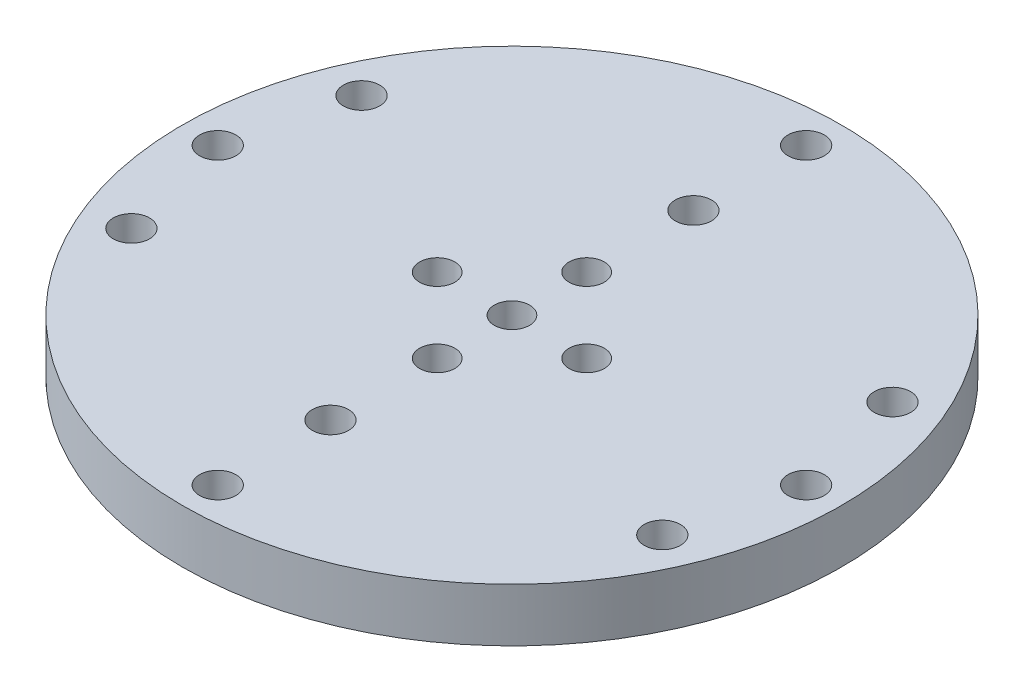
ISO-10303-21;
HEADER;
FILE_DESCRIPTION(('STEP AP214'),'2;1');
FILE_NAME('part.step','',(''),(''),'','','');
FILE_SCHEMA(('AUTOMOTIVE_DESIGN { 1 0 10303 214 1 1 1 1 }'));
ENDSEC;
DATA;
#1=APPLICATION_CONTEXT('core data for automotive mechanical design processes');
#2=APPLICATION_PROTOCOL_DEFINITION('international standard','automotive_design',2000,#1);
#3=PRODUCT_CONTEXT('',#1,'mechanical');
#4=PRODUCT('Part','Part','',(#3));
#5=PRODUCT_RELATED_PRODUCT_CATEGORY('part','',(#4));
#6=PRODUCT_DEFINITION_FORMATION('','',#4);
#7=PRODUCT_DEFINITION_CONTEXT('part definition',#1,'design');
#8=PRODUCT_DEFINITION('design','',#6,#7);
#9=PRODUCT_DEFINITION_SHAPE('','',#8);
#10=(LENGTH_UNIT() NAMED_UNIT(*) SI_UNIT(.MILLI.,.METRE.));
#11=(NAMED_UNIT(*) PLANE_ANGLE_UNIT() SI_UNIT($,.RADIAN.));
#12=(NAMED_UNIT(*) SI_UNIT($,.STERADIAN.) SOLID_ANGLE_UNIT());
#13=UNCERTAINTY_MEASURE_WITH_UNIT(LENGTH_MEASURE(1.E-05),#10,'distance_accuracy_value','');
#14=(GEOMETRIC_REPRESENTATION_CONTEXT(3) GLOBAL_UNCERTAINTY_ASSIGNED_CONTEXT((#13)) GLOBAL_UNIT_ASSIGNED_CONTEXT((#10,
#11,#12)) REPRESENTATION_CONTEXT('',''));
#15=CARTESIAN_POINT('',(0.,0.,0.));
#16=DIRECTION('',(0.,0.,1.));
#17=DIRECTION('',(1.,0.,0.));
#18=AXIS2_PLACEMENT_3D('',#15,#16,#17);
#19=CARTESIAN_POINT('',(0.,9.3,0.));
#20=DIRECTION('',(0.,1.,0.));
#21=DIRECTION('',(0.,0.,1.));
#22=AXIS2_PLACEMENT_3D('',#19,#20,#21);
#23=PLANE('',#22);
#24=CARTESIAN_POINT('',(0.,9.3,17.));
#25=DIRECTION('',(0.,-1.,0.));
#26=DIRECTION('',(0.,0.,-1.));
#27=AXIS2_PLACEMENT_3D('',#24,#25,#26);
#28=CIRCLE('',#27,1.7);
#29=CARTESIAN_POINT('',(0.,9.3,15.3));
#30=VERTEX_POINT('',#29);
#31=EDGE_CURVE('E593',#30,#30,#28,.T.);
#32=ORIENTED_EDGE('',*,*,#31,.T.);
#33=EDGE_LOOP('',(#32));
#34=FACE_BOUND('',#33,.T.);
#35=CARTESIAN_POINT('',(7.0000000000002,9.3,-1.98094713253425E-13));
#36=DIRECTION('',(0.,1.,0.));
#37=DIRECTION('',(0.,0.,1.));
#38=AXIS2_PLACEMENT_3D('',#35,#36,#37);
#39=CIRCLE('',#38,1.65000000000016);
#40=CARTESIAN_POINT('',(7.0000000000002,9.3,1.64999999999996));
#41=VERTEX_POINT('',#40);
#42=EDGE_CURVE('E58',#41,#41,#39,.F.);
#43=ORIENTED_EDGE('',*,*,#42,.T.);
#44=EDGE_LOOP('',(#43));
#45=FACE_BOUND('',#44,.T.);
#46=CARTESIAN_POINT('',(-6.9999999999998,9.3,1.98951966012828E-13));
#47=DIRECTION('',(0.,1.,0.));
#48=DIRECTION('',(0.,0.,1.));
#49=AXIS2_PLACEMENT_3D('',#46,#47,#48);
#50=CIRCLE('',#49,1.65000000000032);
#51=CARTESIAN_POINT('',(-6.9999999999998,9.3,1.65000000000052));
#52=VERTEX_POINT('',#51);
#53=EDGE_CURVE('E130',#52,#52,#50,.F.);
#54=ORIENTED_EDGE('',*,*,#53,.T.);
#55=EDGE_LOOP('',(#54));
#56=FACE_BOUND('',#55,.T.);
#57=CARTESIAN_POINT('',(3.9618942650685E-13,9.3,7.));
#58=DIRECTION('',(0.,1.,0.));
#59=DIRECTION('',(0.,0.,1.));
#60=AXIS2_PLACEMENT_3D('',#57,#58,#59);
#61=CIRCLE('',#60,1.65000000000043);
#62=CARTESIAN_POINT('',(3.9618942650685E-13,9.3,8.65000000000043));
#63=VERTEX_POINT('',#62);
#64=EDGE_CURVE('E128',#63,#63,#61,.F.);
#65=ORIENTED_EDGE('',*,*,#64,.T.);
#66=EDGE_LOOP('',(#65));
#67=FACE_BOUND('',#66,.T.);
#68=CARTESIAN_POINT('',(0.,9.3,0.));
#69=DIRECTION('',(0.,1.,0.));
#70=DIRECTION('',(0.,0.,1.));
#71=AXIS2_PLACEMENT_3D('',#68,#69,#70);
#72=CIRCLE('',#71,1.65);
#73=CARTESIAN_POINT('',(0.,9.3,1.65));
#74=VERTEX_POINT('',#73);
#75=EDGE_CURVE('E131',#74,#74,#72,.F.);
#76=ORIENTED_EDGE('',*,*,#75,.T.);
#77=EDGE_LOOP('',(#76));
#78=FACE_BOUND('',#77,.T.);
#79=CARTESIAN_POINT('',(0.,9.3,-7.));
#80=DIRECTION('',(0.,1.,0.));
#81=DIRECTION('',(0.,0.,1.));
#82=AXIS2_PLACEMENT_3D('',#79,#80,#81);
#83=CIRCLE('',#82,1.65);
#84=CARTESIAN_POINT('',(0.,9.3,-5.35));
#85=VERTEX_POINT('',#84);
#86=EDGE_CURVE('E136',#85,#85,#83,.F.);
#87=ORIENTED_EDGE('',*,*,#86,.T.);
#88=EDGE_LOOP('',(#87));
#89=FACE_BOUND('',#88,.T.);
#90=CARTESIAN_POINT('',(0.,9.3,0.));
#91=DIRECTION('',(0.,1.,0.));
#92=DIRECTION('',(0.,0.,1.));
#93=AXIS2_PLACEMENT_3D('',#90,#91,#92);
#94=CIRCLE('',#93,30.87);
#95=CARTESIAN_POINT('',(0.,9.3,30.87));
#96=VERTEX_POINT('',#95);
#97=EDGE_CURVE('E143',#96,#96,#94,.T.);
#98=ORIENTED_EDGE('',*,*,#97,.T.);
#99=EDGE_LOOP('',(#98));
#100=FACE_BOUND('',#99,.T.);
#101=CARTESIAN_POINT('',(-24.8648374916982,9.3,10.7783703499986));
#102=DIRECTION('',(0.,-1.,0.));
#103=DIRECTION('',(0.,0.,-1.));
#104=AXIS2_PLACEMENT_3D('',#101,#102,#103);
#105=CIRCLE('',#104,1.7);
#106=CARTESIAN_POINT('',(-24.8648374916982,9.3,9.07837034999864));
#107=VERTEX_POINT('',#106);
#108=EDGE_CURVE('E144',#107,#107,#105,.T.);
#109=ORIENTED_EDGE('',*,*,#108,.T.);
#110=EDGE_LOOP('',(#109));
#111=FACE_BOUND('',#110,.T.);
#112=CARTESIAN_POINT('',(-27.5567406999986,9.3,1.92427691826769E-13));
#113=DIRECTION('',(0.,-1.,0.));
#114=DIRECTION('',(0.,0.,-1.));
#115=AXIS2_PLACEMENT_3D('',#112,#113,#114);
#116=CIRCLE('',#115,1.7);
#117=CARTESIAN_POINT('',(-27.5567406999986,9.3,-1.69999999999981));
#118=VERTEX_POINT('',#117);
#119=EDGE_CURVE('E168',#118,#118,#116,.T.);
#120=ORIENTED_EDGE('',*,*,#119,.T.);
#121=EDGE_LOOP('',(#120));
#122=FACE_BOUND('',#121,.T.);
#123=CARTESIAN_POINT('',(-24.8648374916982,9.3,-10.7783703500014));
#124=DIRECTION('',(0.,-1.,0.));
#125=DIRECTION('',(0.,0.,-1.));
#126=AXIS2_PLACEMENT_3D('',#123,#124,#125);
#127=CIRCLE('',#126,1.7);
#128=CARTESIAN_POINT('',(-24.8648374916982,9.3,-12.4783703500014));
#129=VERTEX_POINT('',#128);
#130=EDGE_CURVE('E172',#129,#129,#127,.T.);
#131=ORIENTED_EDGE('',*,*,#130,.T.);
#132=EDGE_LOOP('',(#131));
#133=FACE_BOUND('',#132,.T.);
#134=CARTESIAN_POINT('',(0.,9.3,-27.5567407));
#135=DIRECTION('',(0.,-1.,0.));
#136=DIRECTION('',(0.,0.,-1.));
#137=AXIS2_PLACEMENT_3D('',#134,#135,#136);
#138=CIRCLE('',#137,1.7);
#139=CARTESIAN_POINT('',(0.,9.3,-29.2567407));
#140=VERTEX_POINT('',#139);
#141=EDGE_CURVE('E176',#140,#140,#138,.T.);
#142=ORIENTED_EDGE('',*,*,#141,.T.);
#143=EDGE_LOOP('',(#142));
#144=FACE_BOUND('',#143,.T.);
#145=CARTESIAN_POINT('',(24.8648374917014,9.3,-10.7783703500014));
#146=DIRECTION('',(0.,-1.,0.));
#147=DIRECTION('',(0.,0.,-1.));
#148=AXIS2_PLACEMENT_3D('',#145,#146,#147);
#149=CIRCLE('',#148,1.7);
#150=CARTESIAN_POINT('',(24.8648374917014,9.3,-12.4783703500014));
#151=VERTEX_POINT('',#150);
#152=EDGE_CURVE('E180',#151,#151,#149,.T.);
#153=ORIENTED_EDGE('',*,*,#152,.T.);
#154=EDGE_LOOP('',(#153));
#155=FACE_BOUND('',#154,.T.);
#156=CARTESIAN_POINT('',(27.5567407000014,9.3,0.));
#157=DIRECTION('',(0.,-1.,0.));
#158=DIRECTION('',(0.,0.,-1.));
#159=AXIS2_PLACEMENT_3D('',#156,#157,#158);
#160=CIRCLE('',#159,1.7);
#161=CARTESIAN_POINT('',(27.5567407000014,9.3,-1.7));
#162=VERTEX_POINT('',#161);
#163=EDGE_CURVE('E184',#162,#162,#160,.T.);
#164=ORIENTED_EDGE('',*,*,#163,.T.);
#165=EDGE_LOOP('',(#164));
#166=FACE_BOUND('',#165,.T.);
#167=CARTESIAN_POINT('',(24.8648374917029,9.3,10.7783703499986));
#168=DIRECTION('',(0.,-1.,0.));
#169=DIRECTION('',(0.,0.,-1.));
#170=AXIS2_PLACEMENT_3D('',#167,#168,#169);
#171=CIRCLE('',#170,1.7);
#172=CARTESIAN_POINT('',(24.8648374917029,9.3,9.07837034999864));
#173=VERTEX_POINT('',#172);
#174=EDGE_CURVE('E188',#173,#173,#171,.T.);
#175=ORIENTED_EDGE('',*,*,#174,.T.);
#176=EDGE_LOOP('',(#175));
#177=FACE_BOUND('',#176,.T.);
#178=CARTESIAN_POINT('',(3.12608925323891E-12,9.3,27.5567407));
#179=DIRECTION('',(0.,-1.,0.));
#180=DIRECTION('',(0.,0.,-1.));
#181=AXIS2_PLACEMENT_3D('',#178,#179,#180);
#182=CIRCLE('',#181,1.7);
#183=CARTESIAN_POINT('',(3.12608925323891E-12,9.3,25.8567407));
#184=VERTEX_POINT('',#183);
#185=EDGE_CURVE('E192',#184,#184,#182,.T.);
#186=ORIENTED_EDGE('',*,*,#185,.T.);
#187=EDGE_LOOP('',(#186));
#188=FACE_BOUND('',#187,.T.);
#189=CARTESIAN_POINT('',(0.,9.3,-17.));
#190=DIRECTION('',(0.,-1.,0.));
#191=DIRECTION('',(0.,0.,-1.));
#192=AXIS2_PLACEMENT_3D('',#189,#190,#191);
#193=CIRCLE('',#192,1.7);
#194=CARTESIAN_POINT('',(0.,9.3,-18.7));
#195=VERTEX_POINT('',#194);
#196=EDGE_CURVE('E195',#195,#195,#193,.T.);
#197=ORIENTED_EDGE('',*,*,#196,.T.);
#198=EDGE_LOOP('',(#197));
#199=FACE_BOUND('',#198,.T.);
#200=ADVANCED_FACE('F33',(#34,#45,#56,#67,#78,#89,#100,#111,#122,#133,#144,#155,#166,#177,#188,
#199),#23,.T.);
#201=CARTESIAN_POINT('',(0.,4.3,0.));
#202=DIRECTION('',(0.,1.,0.));
#203=DIRECTION('',(0.,0.,1.));
#204=AXIS2_PLACEMENT_3D('',#201,#202,#203);
#205=PLANE('',#204);
#206=CARTESIAN_POINT('',(3.12608925323891E-12,4.3,27.5567407));
#207=DIRECTION('',(0.,-1.,0.));
#208=DIRECTION('',(0.,0.,-1.));
#209=AXIS2_PLACEMENT_3D('',#206,#207,#208);
#210=CIRCLE('',#209,3.15);
#211=CARTESIAN_POINT('',(3.12608925323891E-12,4.3,24.4067407));
#212=VERTEX_POINT('',#211);
#213=EDGE_CURVE('E197',#212,#212,#210,.T.);
#214=ORIENTED_EDGE('',*,*,#213,.F.);
#215=EDGE_LOOP('',(#214));
#216=FACE_BOUND('',#215,.T.);
#217=CARTESIAN_POINT('',(24.8648374917029,4.3,10.7783703499986));
#218=DIRECTION('',(0.,-1.,0.));
#219=DIRECTION('',(0.,0.,-1.));
#220=AXIS2_PLACEMENT_3D('',#217,#218,#219);
#221=CIRCLE('',#220,3.15);
#222=CARTESIAN_POINT('',(24.8648374917029,4.3,7.62837034999864));
#223=VERTEX_POINT('',#222);
#224=EDGE_CURVE('E211',#223,#223,#221,.T.);
#225=ORIENTED_EDGE('',*,*,#224,.F.);
#226=EDGE_LOOP('',(#225));
#227=FACE_BOUND('',#226,.T.);
#228=CARTESIAN_POINT('',(0.,4.3,0.));
#229=DIRECTION('',(0.,1.,0.));
#230=DIRECTION('',(0.,0.,1.));
#231=AXIS2_PLACEMENT_3D('',#228,#229,#230);
#232=CIRCLE('',#231,22.);
#233=CARTESIAN_POINT('',(0.,4.3,22.));
#234=VERTEX_POINT('',#233);
#235=EDGE_CURVE('E41',#234,#234,#232,.T.);
#236=ORIENTED_EDGE('',*,*,#235,.T.);
#237=EDGE_LOOP('',(#236));
#238=FACE_BOUND('',#237,.T.);
#239=CARTESIAN_POINT('',(0.,4.3,0.));
#240=DIRECTION('',(0.,1.,0.));
#241=DIRECTION('',(0.,0.,1.));
#242=AXIS2_PLACEMENT_3D('',#239,#240,#241);
#243=CIRCLE('',#242,30.87);
#244=CARTESIAN_POINT('',(0.,4.3,30.87));
#245=VERTEX_POINT('',#244);
#246=EDGE_CURVE('E141',#245,#245,#243,.T.);
#247=ORIENTED_EDGE('',*,*,#246,.F.);
#248=EDGE_LOOP('',(#247));
#249=FACE_BOUND('',#248,.T.);
#250=CARTESIAN_POINT('',(-24.8648374916982,4.3,10.7783703499986));
#251=DIRECTION('',(0.,-1.,0.));
#252=DIRECTION('',(0.,0.,-1.));
#253=AXIS2_PLACEMENT_3D('',#250,#251,#252);
#254=CIRCLE('',#253,3.15);
#255=CARTESIAN_POINT('',(-24.8648374916982,4.3,7.62837034999864));
#256=VERTEX_POINT('',#255);
#257=EDGE_CURVE('E155',#256,#256,#254,.T.);
#258=ORIENTED_EDGE('',*,*,#257,.F.);
#259=EDGE_LOOP('',(#258));
#260=FACE_BOUND('',#259,.T.);
#261=CARTESIAN_POINT('',(-27.5567406999986,4.3,1.92427691826769E-13));
#262=DIRECTION('',(0.,-1.,0.));
#263=DIRECTION('',(0.,0.,-1.));
#264=AXIS2_PLACEMENT_3D('',#261,#262,#263);
#265=CIRCLE('',#264,3.15);
#266=CARTESIAN_POINT('',(-27.5567406999986,4.3,-3.14999999999981));
#267=VERTEX_POINT('',#266);
#268=EDGE_CURVE('E246',#267,#267,#265,.T.);
#269=ORIENTED_EDGE('',*,*,#268,.F.);
#270=EDGE_LOOP('',(#269));
#271=FACE_BOUND('',#270,.T.);
#272=CARTESIAN_POINT('',(-24.8648374916982,4.3,-10.7783703500014));
#273=DIRECTION('',(0.,-1.,0.));
#274=DIRECTION('',(0.,0.,-1.));
#275=AXIS2_PLACEMENT_3D('',#272,#273,#274);
#276=CIRCLE('',#275,3.15);
#277=CARTESIAN_POINT('',(-24.8648374916982,4.3,-13.9283703500014));
#278=VERTEX_POINT('',#277);
#279=EDGE_CURVE('E239',#278,#278,#276,.T.);
#280=ORIENTED_EDGE('',*,*,#279,.F.);
#281=EDGE_LOOP('',(#280));
#282=FACE_BOUND('',#281,.T.);
#283=CARTESIAN_POINT('',(0.,4.3,-27.5567407));
#284=DIRECTION('',(0.,-1.,0.));
#285=DIRECTION('',(0.,0.,-1.));
#286=AXIS2_PLACEMENT_3D('',#283,#284,#285);
#287=CIRCLE('',#286,3.15);
#288=CARTESIAN_POINT('',(0.,4.3,-30.7067407));
#289=VERTEX_POINT('',#288);
#290=EDGE_CURVE('E232',#289,#289,#287,.T.);
#291=ORIENTED_EDGE('',*,*,#290,.F.);
#292=EDGE_LOOP('',(#291));
#293=FACE_BOUND('',#292,.T.);
#294=CARTESIAN_POINT('',(24.8648374917014,4.3,-10.7783703500014));
#295=DIRECTION('',(0.,-1.,0.));
#296=DIRECTION('',(0.,0.,-1.));
#297=AXIS2_PLACEMENT_3D('',#294,#295,#296);
#298=CIRCLE('',#297,3.15);
#299=CARTESIAN_POINT('',(24.8648374917014,4.3,-13.9283703500014));
#300=VERTEX_POINT('',#299);
#301=EDGE_CURVE('E225',#300,#300,#298,.T.);
#302=ORIENTED_EDGE('',*,*,#301,.F.);
#303=EDGE_LOOP('',(#302));
#304=FACE_BOUND('',#303,.T.);
#305=CARTESIAN_POINT('',(27.5567407000014,4.3,0.));
#306=DIRECTION('',(0.,-1.,0.));
#307=DIRECTION('',(0.,0.,-1.));
#308=AXIS2_PLACEMENT_3D('',#305,#306,#307);
#309=CIRCLE('',#308,3.15);
#310=CARTESIAN_POINT('',(27.5567407000014,4.3,-3.15));
#311=VERTEX_POINT('',#310);
#312=EDGE_CURVE('E218',#311,#311,#309,.T.);
#313=ORIENTED_EDGE('',*,*,#312,.F.);
#314=EDGE_LOOP('',(#313));
#315=FACE_BOUND('',#314,.T.);
#316=ADVANCED_FACE('F88',(#216,#227,#238,#249,#260,#271,#282,#293,#304,#315),#205,.F.);
#317=CARTESIAN_POINT('',(0.,4.3,0.));
#318=DIRECTION('',(0.,-1.,0.));
#319=DIRECTION('',(0.,0.,-1.));
#320=AXIS2_PLACEMENT_3D('',#317,#318,#319);
#321=CYLINDRICAL_SURFACE('',#320,22.);
#322=ORIENTED_EDGE('',*,*,#235,.F.);
#323=EDGE_LOOP('',(#322));
#324=FACE_BOUND('',#323,.T.);
#325=CARTESIAN_POINT('',(0.,0.,0.));
#326=DIRECTION('',(0.,1.,0.));
#327=DIRECTION('',(0.,0.,1.));
#328=AXIS2_PLACEMENT_3D('',#325,#326,#327);
#329=CIRCLE('',#328,22.);
#330=CARTESIAN_POINT('',(0.,0.,22.));
#331=VERTEX_POINT('',#330);
#332=EDGE_CURVE('E46',#331,#331,#329,.T.);
#333=ORIENTED_EDGE('',*,*,#332,.T.);
#334=EDGE_LOOP('',(#333));
#335=FACE_BOUND('',#334,.T.);
#336=ADVANCED_FACE('F35',(#324,#335),#321,.T.);
#337=CARTESIAN_POINT('',(0.,0.,0.));
#338=DIRECTION('',(0.,1.,0.));
#339=DIRECTION('',(0.,0.,1.));
#340=AXIS2_PLACEMENT_3D('',#337,#338,#339);
#341=PLANE('',#340);
#342=CARTESIAN_POINT('',(0.,0.,17.));
#343=DIRECTION('',(0.,-1.,0.));
#344=DIRECTION('',(0.,0.,-1.));
#345=AXIS2_PLACEMENT_3D('',#342,#343,#344);
#346=CIRCLE('',#345,3.15);
#347=CARTESIAN_POINT('',(0.,0.,13.85));
#348=VERTEX_POINT('',#347);
#349=EDGE_CURVE('E591',#348,#348,#346,.T.);
#350=ORIENTED_EDGE('',*,*,#349,.F.);
#351=EDGE_LOOP('',(#350));
#352=FACE_BOUND('',#351,.T.);
#353=CARTESIAN_POINT('',(0.,0.,-17.));
#354=DIRECTION('',(0.,-1.,0.));
#355=DIRECTION('',(0.,0.,-1.));
#356=AXIS2_PLACEMENT_3D('',#353,#354,#355);
#357=CIRCLE('',#356,3.15);
#358=CARTESIAN_POINT('',(0.,0.,-20.15));
#359=VERTEX_POINT('',#358);
#360=EDGE_CURVE('E204',#359,#359,#357,.T.);
#361=ORIENTED_EDGE('',*,*,#360,.F.);
#362=EDGE_LOOP('',(#361));
#363=FACE_BOUND('',#362,.T.);
#364=CARTESIAN_POINT('',(0.,0.,0.));
#365=DIRECTION('',(0.,-1.,0.));
#366=DIRECTION('',(0.,0.,-1.));
#367=AXIS2_PLACEMENT_3D('',#364,#365,#366);
#368=CIRCLE('',#367,12.);
#369=CARTESIAN_POINT('',(0.,0.,-12.));
#370=VERTEX_POINT('',#369);
#371=EDGE_CURVE('E10',#370,#370,#368,.T.);
#372=ORIENTED_EDGE('',*,*,#371,.F.);
#373=EDGE_LOOP('',(#372));
#374=FACE_BOUND('',#373,.T.);
#375=ORIENTED_EDGE('',*,*,#332,.F.);
#376=EDGE_LOOP('',(#375));
#377=FACE_BOUND('',#376,.T.);
#378=ADVANCED_FACE('F77',(#352,#363,#374,#377),#341,.F.);
#379=CARTESIAN_POINT('',(0.,-8.25,0.));
#380=DIRECTION('',(0.,1.,0.));
#381=DIRECTION('',(0.,0.,1.));
#382=AXIS2_PLACEMENT_3D('',#379,#380,#381);
#383=CYLINDRICAL_SURFACE('',#382,12.);
#384=CARTESIAN_POINT('',(0.,-8.25,0.));
#385=DIRECTION('',(0.,-1.,0.));
#386=DIRECTION('',(0.,0.,-1.));
#387=AXIS2_PLACEMENT_3D('',#384,#385,#386);
#388=CIRCLE('',#387,12.);
#389=CARTESIAN_POINT('',(0.,-8.25,-12.));
#390=VERTEX_POINT('',#389);
#391=EDGE_CURVE('E49',#390,#390,#388,.T.);
#392=ORIENTED_EDGE('',*,*,#391,.F.);
#393=EDGE_LOOP('',(#392));
#394=FACE_BOUND('',#393,.T.);
#395=ORIENTED_EDGE('',*,*,#371,.T.);
#396=EDGE_LOOP('',(#395));
#397=FACE_BOUND('',#396,.T.);
#398=ADVANCED_FACE('F75',(#394,#397),#383,.T.);
#399=CARTESIAN_POINT('',(0.,-8.25,0.));
#400=DIRECTION('',(0.,-1.,0.));
#401=DIRECTION('',(0.,0.,-1.));
#402=AXIS2_PLACEMENT_3D('',#399,#400,#401);
#403=PLANE('',#402);
#404=CARTESIAN_POINT('',(7.0000000000002,-8.25,-1.98094713253425E-13));
#405=DIRECTION('',(0.,-1.,0.));
#406=DIRECTION('',(0.,0.,-1.));
#407=AXIS2_PLACEMENT_3D('',#404,#405,#406);
#408=CIRCLE('',#407,1.65000000000016);
#409=CARTESIAN_POINT('',(7.0000000000002,-8.25,-1.65000000000035));
#410=VERTEX_POINT('',#409);
#411=EDGE_CURVE('E37',#410,#410,#408,.T.);
#412=ORIENTED_EDGE('',*,*,#411,.F.);
#413=EDGE_LOOP('',(#412));
#414=FACE_BOUND('',#413,.T.);
#415=CARTESIAN_POINT('',(0.,-8.25,-7.));
#416=DIRECTION('',(0.,-1.,0.));
#417=DIRECTION('',(0.,0.,-1.));
#418=AXIS2_PLACEMENT_3D('',#415,#416,#417);
#419=CIRCLE('',#418,1.65);
#420=CARTESIAN_POINT('',(0.,-8.25,-8.65));
#421=VERTEX_POINT('',#420);
#422=EDGE_CURVE('E63',#421,#421,#419,.T.);
#423=ORIENTED_EDGE('',*,*,#422,.F.);
#424=EDGE_LOOP('',(#423));
#425=FACE_BOUND('',#424,.T.);
#426=CARTESIAN_POINT('',(-6.9999999999998,-8.25,1.98951966012828E-13));
#427=DIRECTION('',(0.,-1.,0.));
#428=DIRECTION('',(0.,0.,-1.));
#429=AXIS2_PLACEMENT_3D('',#426,#427,#428);
#430=CIRCLE('',#429,1.65000000000032);
#431=CARTESIAN_POINT('',(-6.9999999999998,-8.25,-1.65000000000012));
#432=VERTEX_POINT('',#431);
#433=EDGE_CURVE('E61',#432,#432,#430,.T.);
#434=ORIENTED_EDGE('',*,*,#433,.F.);
#435=EDGE_LOOP('',(#434));
#436=FACE_BOUND('',#435,.T.);
#437=CARTESIAN_POINT('',(3.9618942650685E-13,-8.25,7.));
#438=DIRECTION('',(0.,-1.,0.));
#439=DIRECTION('',(0.,0.,-1.));
#440=AXIS2_PLACEMENT_3D('',#437,#438,#439);
#441=CIRCLE('',#440,1.65000000000043);
#442=CARTESIAN_POINT('',(3.9618942650685E-13,-8.25,5.34999999999958));
#443=VERTEX_POINT('',#442);
#444=EDGE_CURVE('E57',#443,#443,#441,.T.);
#445=ORIENTED_EDGE('',*,*,#444,.F.);
#446=EDGE_LOOP('',(#445));
#447=FACE_BOUND('',#446,.T.);
#448=CARTESIAN_POINT('',(0.,-8.25,0.));
#449=DIRECTION('',(0.,-1.,0.));
#450=DIRECTION('',(0.,0.,-1.));
#451=AXIS2_PLACEMENT_3D('',#448,#449,#450);
#452=CIRCLE('',#451,1.65);
#453=CARTESIAN_POINT('',(0.,-8.25,-1.65));
#454=VERTEX_POINT('',#453);
#455=EDGE_CURVE('E54',#454,#454,#452,.T.);
#456=ORIENTED_EDGE('',*,*,#455,.F.);
#457=EDGE_LOOP('',(#456));
#458=FACE_BOUND('',#457,.T.);
#459=ORIENTED_EDGE('',*,*,#391,.T.);
#460=EDGE_LOOP('',(#459));
#461=FACE_BOUND('',#460,.T.);
#462=ADVANCED_FACE('F73',(#414,#425,#436,#447,#458,#461),#403,.T.);
#463=CARTESIAN_POINT('',(0.,-10.2,0.));
#464=DIRECTION('',(0.,1.,0.));
#465=DIRECTION('',(0.,0.,1.));
#466=AXIS2_PLACEMENT_3D('',#463,#464,#465);
#467=CYLINDRICAL_SURFACE('',#466,1.65);
#468=ORIENTED_EDGE('',*,*,#455,.T.);
#469=EDGE_LOOP('',(#468));
#470=FACE_BOUND('',#469,.T.);
#471=ORIENTED_EDGE('',*,*,#75,.F.);
#472=EDGE_LOOP('',(#471));
#473=FACE_BOUND('',#472,.T.);
#474=ADVANCED_FACE('F83',(#470,#473),#467,.F.);
#475=CARTESIAN_POINT('',(3.9618942650685E-13,-10.2,7.));
#476=DIRECTION('',(0.,1.,0.));
#477=DIRECTION('',(0.,0.,1.));
#478=AXIS2_PLACEMENT_3D('',#475,#476,#477);
#479=CYLINDRICAL_SURFACE('',#478,1.65000000000043);
#480=ORIENTED_EDGE('',*,*,#444,.T.);
#481=EDGE_LOOP('',(#480));
#482=FACE_BOUND('',#481,.T.);
#483=ORIENTED_EDGE('',*,*,#64,.F.);
#484=EDGE_LOOP('',(#483));
#485=FACE_BOUND('',#484,.T.);
#486=ADVANCED_FACE('F113',(#482,#485),#479,.F.);
#487=CARTESIAN_POINT('',(-6.9999999999998,-10.2,1.98951966012828E-13));
#488=DIRECTION('',(0.,1.,0.));
#489=DIRECTION('',(0.,0.,1.));
#490=AXIS2_PLACEMENT_3D('',#487,#488,#489);
#491=CYLINDRICAL_SURFACE('',#490,1.65000000000032);
#492=ORIENTED_EDGE('',*,*,#433,.T.);
#493=EDGE_LOOP('',(#492));
#494=FACE_BOUND('',#493,.T.);
#495=ORIENTED_EDGE('',*,*,#53,.F.);
#496=EDGE_LOOP('',(#495));
#497=FACE_BOUND('',#496,.T.);
#498=ADVANCED_FACE('F110',(#494,#497),#491,.F.);
#499=CARTESIAN_POINT('',(0.,-10.2,-7.));
#500=DIRECTION('',(0.,1.,0.));
#501=DIRECTION('',(0.,0.,1.));
#502=AXIS2_PLACEMENT_3D('',#499,#500,#501);
#503=CYLINDRICAL_SURFACE('',#502,1.65);
#504=ORIENTED_EDGE('',*,*,#422,.T.);
#505=EDGE_LOOP('',(#504));
#506=FACE_BOUND('',#505,.T.);
#507=ORIENTED_EDGE('',*,*,#86,.F.);
#508=EDGE_LOOP('',(#507));
#509=FACE_BOUND('',#508,.T.);
#510=ADVANCED_FACE('F109',(#506,#509),#503,.F.);
#511=CARTESIAN_POINT('',(7.0000000000002,-10.2,-1.98094713253425E-13));
#512=DIRECTION('',(0.,1.,0.));
#513=DIRECTION('',(0.,0.,1.));
#514=AXIS2_PLACEMENT_3D('',#511,#512,#513);
#515=CYLINDRICAL_SURFACE('',#514,1.65000000000016);
#516=ORIENTED_EDGE('',*,*,#411,.T.);
#517=EDGE_LOOP('',(#516));
#518=FACE_BOUND('',#517,.T.);
#519=ORIENTED_EDGE('',*,*,#42,.F.);
#520=EDGE_LOOP('',(#519));
#521=FACE_BOUND('',#520,.T.);
#522=ADVANCED_FACE('F105',(#518,#521),#515,.F.);
#523=CARTESIAN_POINT('',(0.,9.3,0.));
#524=DIRECTION('',(0.,-1.,0.));
#525=DIRECTION('',(0.,0.,-1.));
#526=AXIS2_PLACEMENT_3D('',#523,#524,#525);
#527=CYLINDRICAL_SURFACE('',#526,30.87);
#528=ORIENTED_EDGE('',*,*,#97,.F.);
#529=EDGE_LOOP('',(#528));
#530=FACE_BOUND('',#529,.T.);
#531=ORIENTED_EDGE('',*,*,#246,.T.);
#532=EDGE_LOOP('',(#531));
#533=FACE_BOUND('',#532,.T.);
#534=ADVANCED_FACE('F102',(#530,#533),#527,.T.);
#535=CARTESIAN_POINT('',(-24.8648374916982,4.3,10.7783703499986));
#536=DIRECTION('',(0.,-1.,0.));
#537=DIRECTION('',(0.,0.,-1.));
#538=AXIS2_PLACEMENT_3D('',#535,#536,#537);
#539=CYLINDRICAL_SURFACE('',#538,1.69999999999999);
#540=ORIENTED_EDGE('',*,*,#108,.F.);
#541=EDGE_LOOP('',(#540));
#542=FACE_BOUND('',#541,.T.);
#543=CARTESIAN_POINT('',(-24.8648374916982,5.75000000000001,10.7783703499986));
#544=DIRECTION('',(0.,-1.,0.));
#545=DIRECTION('',(0.,0.,-1.));
#546=AXIS2_PLACEMENT_3D('',#543,#544,#545);
#547=CIRCLE('',#546,1.69999999999999);
#548=CARTESIAN_POINT('',(-24.8648374916982,5.75000000000001,9.07837034999865));
#549=VERTEX_POINT('',#548);
#550=EDGE_CURVE('E150',#549,#549,#547,.T.);
#551=ORIENTED_EDGE('',*,*,#550,.T.);
#552=EDGE_LOOP('',(#551));
#553=FACE_BOUND('',#552,.T.);
#554=ADVANCED_FACE('F99',(#542,#553),#539,.F.);
#555=CARTESIAN_POINT('',(-24.8648374916982,4.3,10.7783703499986));
#556=DIRECTION('',(0.,-1.,0.));
#557=DIRECTION('',(0.,0.,-1.));
#558=AXIS2_PLACEMENT_3D('',#555,#556,#557);
#559=CONICAL_SURFACE('',#558,3.15,0.785398163397449);
#560=ORIENTED_EDGE('',*,*,#550,.F.);
#561=EDGE_LOOP('',(#560));
#562=FACE_BOUND('',#561,.T.);
#563=ORIENTED_EDGE('',*,*,#257,.T.);
#564=EDGE_LOOP('',(#563));
#565=FACE_BOUND('',#564,.T.);
#566=ADVANCED_FACE('F255',(#562,#565),#559,.F.);
#567=CARTESIAN_POINT('',(-27.5567406999986,4.3,1.92427691826769E-13));
#568=DIRECTION('',(0.,-1.,0.));
#569=DIRECTION('',(0.,0.,-1.));
#570=AXIS2_PLACEMENT_3D('',#567,#568,#569);
#571=CYLINDRICAL_SURFACE('',#570,1.69999999999999);
#572=ORIENTED_EDGE('',*,*,#119,.F.);
#573=EDGE_LOOP('',(#572));
#574=FACE_BOUND('',#573,.T.);
#575=CARTESIAN_POINT('',(-27.5567406999986,5.75000000000001,1.92427691826769E-13));
#576=DIRECTION('',(0.,-1.,0.));
#577=DIRECTION('',(0.,0.,-1.));
#578=AXIS2_PLACEMENT_3D('',#575,#576,#577);
#579=CIRCLE('',#578,1.69999999999999);
#580=CARTESIAN_POINT('',(-27.5567406999986,5.75000000000001,-1.69999999999979));
#581=VERTEX_POINT('',#580);
#582=EDGE_CURVE('E249',#581,#581,#579,.T.);
#583=ORIENTED_EDGE('',*,*,#582,.T.);
#584=EDGE_LOOP('',(#583));
#585=FACE_BOUND('',#584,.T.);
#586=ADVANCED_FACE('F313',(#574,#585),#571,.F.);
#587=CARTESIAN_POINT('',(-27.5567406999986,4.3,1.92427691826769E-13));
#588=DIRECTION('',(0.,-1.,0.));
#589=DIRECTION('',(0.,0.,-1.));
#590=AXIS2_PLACEMENT_3D('',#587,#588,#589);
#591=CONICAL_SURFACE('',#590,3.15,0.78539816339745);
#592=ORIENTED_EDGE('',*,*,#582,.F.);
#593=EDGE_LOOP('',(#592));
#594=FACE_BOUND('',#593,.T.);
#595=ORIENTED_EDGE('',*,*,#268,.T.);
#596=EDGE_LOOP('',(#595));
#597=FACE_BOUND('',#596,.T.);
#598=ADVANCED_FACE('F309',(#594,#597),#591,.F.);
#599=CARTESIAN_POINT('',(-24.8648374916982,4.3,-10.7783703500014));
#600=DIRECTION('',(0.,-1.,0.));
#601=DIRECTION('',(0.,0.,-1.));
#602=AXIS2_PLACEMENT_3D('',#599,#600,#601);
#603=CYLINDRICAL_SURFACE('',#602,1.69999999999999);
#604=ORIENTED_EDGE('',*,*,#130,.F.);
#605=EDGE_LOOP('',(#604));
#606=FACE_BOUND('',#605,.T.);
#607=CARTESIAN_POINT('',(-24.8648374916982,5.75000000000001,-10.7783703500014));
#608=DIRECTION('',(0.,-1.,0.));
#609=DIRECTION('',(0.,0.,-1.));
#610=AXIS2_PLACEMENT_3D('',#607,#608,#609);
#611=CIRCLE('',#610,1.69999999999999);
#612=CARTESIAN_POINT('',(-24.8648374916982,5.75000000000001,-12.4783703500013));
#613=VERTEX_POINT('',#612);
#614=EDGE_CURVE('E242',#613,#613,#611,.T.);
#615=ORIENTED_EDGE('',*,*,#614,.T.);
#616=EDGE_LOOP('',(#615));
#617=FACE_BOUND('',#616,.T.);
#618=ADVANCED_FACE('F305',(#606,#617),#603,.F.);
#619=CARTESIAN_POINT('',(-24.8648374916982,4.3,-10.7783703500014));
#620=DIRECTION('',(0.,-1.,0.));
#621=DIRECTION('',(0.,0.,-1.));
#622=AXIS2_PLACEMENT_3D('',#619,#620,#621);
#623=CONICAL_SURFACE('',#622,3.15,0.785398163397449);
#624=ORIENTED_EDGE('',*,*,#614,.F.);
#625=EDGE_LOOP('',(#624));
#626=FACE_BOUND('',#625,.T.);
#627=ORIENTED_EDGE('',*,*,#279,.T.);
#628=EDGE_LOOP('',(#627));
#629=FACE_BOUND('',#628,.T.);
#630=ADVANCED_FACE('F301',(#626,#629),#623,.F.);
#631=CARTESIAN_POINT('',(0.,4.3,-27.5567407));
#632=DIRECTION('',(0.,-1.,0.));
#633=DIRECTION('',(0.,0.,-1.));
#634=AXIS2_PLACEMENT_3D('',#631,#632,#633);
#635=CYLINDRICAL_SURFACE('',#634,1.69999999999999);
#636=ORIENTED_EDGE('',*,*,#141,.F.);
#637=EDGE_LOOP('',(#636));
#638=FACE_BOUND('',#637,.T.);
#639=CARTESIAN_POINT('',(0.,5.75000000000001,-27.5567407));
#640=DIRECTION('',(0.,-1.,0.));
#641=DIRECTION('',(0.,0.,-1.));
#642=AXIS2_PLACEMENT_3D('',#639,#640,#641);
#643=CIRCLE('',#642,1.69999999999999);
#644=CARTESIAN_POINT('',(0.,5.75000000000001,-29.2567407));
#645=VERTEX_POINT('',#644);
#646=EDGE_CURVE('E235',#645,#645,#643,.T.);
#647=ORIENTED_EDGE('',*,*,#646,.T.);
#648=EDGE_LOOP('',(#647));
#649=FACE_BOUND('',#648,.T.);
#650=ADVANCED_FACE('F297',(#638,#649),#635,.F.);
#651=CARTESIAN_POINT('',(0.,4.3,-27.5567407));
#652=DIRECTION('',(0.,-1.,0.));
#653=DIRECTION('',(0.,0.,-1.));
#654=AXIS2_PLACEMENT_3D('',#651,#652,#653);
#655=CONICAL_SURFACE('',#654,3.15,0.78539816339745);
#656=ORIENTED_EDGE('',*,*,#646,.F.);
#657=EDGE_LOOP('',(#656));
#658=FACE_BOUND('',#657,.T.);
#659=ORIENTED_EDGE('',*,*,#290,.T.);
#660=EDGE_LOOP('',(#659));
#661=FACE_BOUND('',#660,.T.);
#662=ADVANCED_FACE('F293',(#658,#661),#655,.F.);
#663=CARTESIAN_POINT('',(24.8648374917014,4.3,-10.7783703500014));
#664=DIRECTION('',(0.,-1.,0.));
#665=DIRECTION('',(0.,0.,-1.));
#666=AXIS2_PLACEMENT_3D('',#663,#664,#665);
#667=CYLINDRICAL_SURFACE('',#666,1.69999999999999);
#668=ORIENTED_EDGE('',*,*,#152,.F.);
#669=EDGE_LOOP('',(#668));
#670=FACE_BOUND('',#669,.T.);
#671=CARTESIAN_POINT('',(24.8648374917014,5.75000000000001,-10.7783703500014));
#672=DIRECTION('',(0.,-1.,0.));
#673=DIRECTION('',(0.,0.,-1.));
#674=AXIS2_PLACEMENT_3D('',#671,#672,#673);
#675=CIRCLE('',#674,1.69999999999999);
#676=CARTESIAN_POINT('',(24.8648374917014,5.75000000000001,-12.4783703500013));
#677=VERTEX_POINT('',#676);
#678=EDGE_CURVE('E228',#677,#677,#675,.T.);
#679=ORIENTED_EDGE('',*,*,#678,.T.);
#680=EDGE_LOOP('',(#679));
#681=FACE_BOUND('',#680,.T.);
#682=ADVANCED_FACE('F289',(#670,#681),#667,.F.);
#683=CARTESIAN_POINT('',(24.8648374917014,4.3,-10.7783703500014));
#684=DIRECTION('',(0.,-1.,0.));
#685=DIRECTION('',(0.,0.,-1.));
#686=AXIS2_PLACEMENT_3D('',#683,#684,#685);
#687=CONICAL_SURFACE('',#686,3.15,0.78539816339745);
#688=ORIENTED_EDGE('',*,*,#678,.F.);
#689=EDGE_LOOP('',(#688));
#690=FACE_BOUND('',#689,.T.);
#691=ORIENTED_EDGE('',*,*,#301,.T.);
#692=EDGE_LOOP('',(#691));
#693=FACE_BOUND('',#692,.T.);
#694=ADVANCED_FACE('F281',(#690,#693),#687,.F.);
#695=CARTESIAN_POINT('',(27.5567407000014,4.3,0.));
#696=DIRECTION('',(0.,-1.,0.));
#697=DIRECTION('',(0.,0.,-1.));
#698=AXIS2_PLACEMENT_3D('',#695,#696,#697);
#699=CYLINDRICAL_SURFACE('',#698,1.69999999999999);
#700=ORIENTED_EDGE('',*,*,#163,.F.);
#701=EDGE_LOOP('',(#700));
#702=FACE_BOUND('',#701,.T.);
#703=CARTESIAN_POINT('',(27.5567407000014,5.75000000000001,0.));
#704=DIRECTION('',(0.,-1.,0.));
#705=DIRECTION('',(0.,0.,-1.));
#706=AXIS2_PLACEMENT_3D('',#703,#704,#705);
#707=CIRCLE('',#706,1.69999999999999);
#708=CARTESIAN_POINT('',(27.5567407000014,5.75000000000001,-1.69999999999999));
#709=VERTEX_POINT('',#708);
#710=EDGE_CURVE('E221',#709,#709,#707,.T.);
#711=ORIENTED_EDGE('',*,*,#710,.T.);
#712=EDGE_LOOP('',(#711));
#713=FACE_BOUND('',#712,.T.);
#714=ADVANCED_FACE('F271',(#702,#713),#699,.F.);
#715=CARTESIAN_POINT('',(27.5567407000014,4.3,0.));
#716=DIRECTION('',(0.,-1.,0.));
#717=DIRECTION('',(0.,0.,-1.));
#718=AXIS2_PLACEMENT_3D('',#715,#716,#717);
#719=CONICAL_SURFACE('',#718,3.15,0.78539816339745);
#720=ORIENTED_EDGE('',*,*,#710,.F.);
#721=EDGE_LOOP('',(#720));
#722=FACE_BOUND('',#721,.T.);
#723=ORIENTED_EDGE('',*,*,#312,.T.);
#724=EDGE_LOOP('',(#723));
#725=FACE_BOUND('',#724,.T.);
#726=ADVANCED_FACE('F268',(#722,#725),#719,.F.);
#727=CARTESIAN_POINT('',(24.8648374917029,4.3,10.7783703499986));
#728=DIRECTION('',(0.,-1.,0.));
#729=DIRECTION('',(0.,0.,-1.));
#730=AXIS2_PLACEMENT_3D('',#727,#728,#729);
#731=CYLINDRICAL_SURFACE('',#730,1.69999999999999);
#732=ORIENTED_EDGE('',*,*,#174,.F.);
#733=EDGE_LOOP('',(#732));
#734=FACE_BOUND('',#733,.T.);
#735=CARTESIAN_POINT('',(24.8648374917029,5.75000000000001,10.7783703499986));
#736=DIRECTION('',(0.,-1.,0.));
#737=DIRECTION('',(0.,0.,-1.));
#738=AXIS2_PLACEMENT_3D('',#735,#736,#737);
#739=CIRCLE('',#738,1.69999999999999);
#740=CARTESIAN_POINT('',(24.8648374917029,5.75000000000001,9.07837034999866));
#741=VERTEX_POINT('',#740);
#742=EDGE_CURVE('E214',#741,#741,#739,.T.);
#743=ORIENTED_EDGE('',*,*,#742,.T.);
#744=EDGE_LOOP('',(#743));
#745=FACE_BOUND('',#744,.T.);
#746=ADVANCED_FACE('F270',(#734,#745),#731,.F.);
#747=CARTESIAN_POINT('',(24.8648374917029,4.3,10.7783703499986));
#748=DIRECTION('',(0.,-1.,0.));
#749=DIRECTION('',(0.,0.,-1.));
#750=AXIS2_PLACEMENT_3D('',#747,#748,#749);
#751=CONICAL_SURFACE('',#750,3.15,0.78539816339745);
#752=ORIENTED_EDGE('',*,*,#742,.F.);
#753=EDGE_LOOP('',(#752));
#754=FACE_BOUND('',#753,.T.);
#755=ORIENTED_EDGE('',*,*,#224,.T.);
#756=EDGE_LOOP('',(#755));
#757=FACE_BOUND('',#756,.T.);
#758=ADVANCED_FACE('F278',(#754,#757),#751,.F.);
#759=CARTESIAN_POINT('',(3.12608925323891E-12,4.3,27.5567407));
#760=DIRECTION('',(0.,-1.,0.));
#761=DIRECTION('',(0.,0.,-1.));
#762=AXIS2_PLACEMENT_3D('',#759,#760,#761);
#763=CYLINDRICAL_SURFACE('',#762,1.69999999999999);
#764=ORIENTED_EDGE('',*,*,#185,.F.);
#765=EDGE_LOOP('',(#764));
#766=FACE_BOUND('',#765,.T.);
#767=CARTESIAN_POINT('',(3.12608925323891E-12,5.75000000000001,27.5567407));
#768=DIRECTION('',(0.,-1.,0.));
#769=DIRECTION('',(0.,0.,-1.));
#770=AXIS2_PLACEMENT_3D('',#767,#768,#769);
#771=CIRCLE('',#770,1.69999999999999);
#772=CARTESIAN_POINT('',(3.12608925323891E-12,5.75000000000001,25.8567407));
#773=VERTEX_POINT('',#772);
#774=EDGE_CURVE('E201',#773,#773,#771,.T.);
#775=ORIENTED_EDGE('',*,*,#774,.T.);
#776=EDGE_LOOP('',(#775));
#777=FACE_BOUND('',#776,.T.);
#778=ADVANCED_FACE('F436',(#766,#777),#763,.F.);
#779=CARTESIAN_POINT('',(3.12608925323891E-12,4.3,27.5567407));
#780=DIRECTION('',(0.,-1.,0.));
#781=DIRECTION('',(0.,0.,-1.));
#782=AXIS2_PLACEMENT_3D('',#779,#780,#781);
#783=CONICAL_SURFACE('',#782,3.15,0.78539816339745);
#784=ORIENTED_EDGE('',*,*,#774,.F.);
#785=EDGE_LOOP('',(#784));
#786=FACE_BOUND('',#785,.T.);
#787=ORIENTED_EDGE('',*,*,#213,.T.);
#788=EDGE_LOOP('',(#787));
#789=FACE_BOUND('',#788,.T.);
#790=ADVANCED_FACE('F398',(#786,#789),#783,.F.);
#791=CARTESIAN_POINT('',(0.,0.,-17.));
#792=DIRECTION('',(0.,-1.,0.));
#793=DIRECTION('',(0.,0.,-1.));
#794=AXIS2_PLACEMENT_3D('',#791,#792,#793);
#795=CYLINDRICAL_SURFACE('',#794,1.69999999999999);
#796=ORIENTED_EDGE('',*,*,#196,.F.);
#797=EDGE_LOOP('',(#796));
#798=FACE_BOUND('',#797,.T.);
#799=CARTESIAN_POINT('',(0.,1.45000000000001,-17.));
#800=DIRECTION('',(0.,-1.,0.));
#801=DIRECTION('',(0.,0.,-1.));
#802=AXIS2_PLACEMENT_3D('',#799,#800,#801);
#803=CIRCLE('',#802,1.69999999999999);
#804=CARTESIAN_POINT('',(0.,1.45000000000001,-18.7));
#805=VERTEX_POINT('',#804);
#806=EDGE_CURVE('E198',#805,#805,#803,.T.);
#807=ORIENTED_EDGE('',*,*,#806,.T.);
#808=EDGE_LOOP('',(#807));
#809=FACE_BOUND('',#808,.T.);
#810=ADVANCED_FACE('F392',(#798,#809),#795,.F.);
#811=CARTESIAN_POINT('',(0.,0.,-17.));
#812=DIRECTION('',(0.,-1.,0.));
#813=DIRECTION('',(0.,0.,-1.));
#814=AXIS2_PLACEMENT_3D('',#811,#812,#813);
#815=CONICAL_SURFACE('',#814,3.15,0.78539816339745);
#816=ORIENTED_EDGE('',*,*,#806,.F.);
#817=EDGE_LOOP('',(#816));
#818=FACE_BOUND('',#817,.T.);
#819=ORIENTED_EDGE('',*,*,#360,.T.);
#820=EDGE_LOOP('',(#819));
#821=FACE_BOUND('',#820,.T.);
#822=ADVANCED_FACE('F397',(#818,#821),#815,.F.);
#823=CARTESIAN_POINT('',(0.,0.,17.));
#824=DIRECTION('',(0.,-1.,0.));
#825=DIRECTION('',(0.,0.,-1.));
#826=AXIS2_PLACEMENT_3D('',#823,#824,#825);
#827=CYLINDRICAL_SURFACE('',#826,1.69999999999999);
#828=ORIENTED_EDGE('',*,*,#31,.F.);
#829=EDGE_LOOP('',(#828));
#830=FACE_BOUND('',#829,.T.);
#831=CARTESIAN_POINT('',(0.,1.45000000000001,17.));
#832=DIRECTION('',(0.,-1.,0.));
#833=DIRECTION('',(0.,0.,-1.));
#834=AXIS2_PLACEMENT_3D('',#831,#832,#833);
#835=CIRCLE('',#834,1.69999999999999);
#836=CARTESIAN_POINT('',(0.,1.45000000000001,15.3));
#837=VERTEX_POINT('',#836);
#838=EDGE_CURVE('E588',#837,#837,#835,.T.);
#839=ORIENTED_EDGE('',*,*,#838,.T.);
#840=EDGE_LOOP('',(#839));
#841=FACE_BOUND('',#840,.T.);
#842=ADVANCED_FACE('F408',(#830,#841),#827,.F.);
#843=CARTESIAN_POINT('',(0.,0.,17.));
#844=DIRECTION('',(0.,-1.,0.));
#845=DIRECTION('',(0.,0.,-1.));
#846=AXIS2_PLACEMENT_3D('',#843,#844,#845);
#847=CONICAL_SURFACE('',#846,3.15,0.78539816339745);
#848=ORIENTED_EDGE('',*,*,#838,.F.);
#849=EDGE_LOOP('',(#848));
#850=FACE_BOUND('',#849,.T.);
#851=ORIENTED_EDGE('',*,*,#349,.T.);
#852=EDGE_LOOP('',(#851));
#853=FACE_BOUND('',#852,.T.);
#854=ADVANCED_FACE('F418',(#850,#853),#847,.F.);
#855=CLOSED_SHELL('',(#200,#316,#336,#378,#398,#462,#474,#486,#498,#510,#522,#534,#554,#566,
#586,#598,#618,#630,#650,#662,#682,#694,#714,#726,#746,#758,#778,#790,#810,#822,#842,#854));
#856=MANIFOLD_SOLID_BREP('B2',#855);
#857=ADVANCED_BREP_SHAPE_REPRESENTATION('',(#18,#856),#14);
#858=SHAPE_DEFINITION_REPRESENTATION(#9,#857);
ENDSEC;
END-ISO-10303-21;
